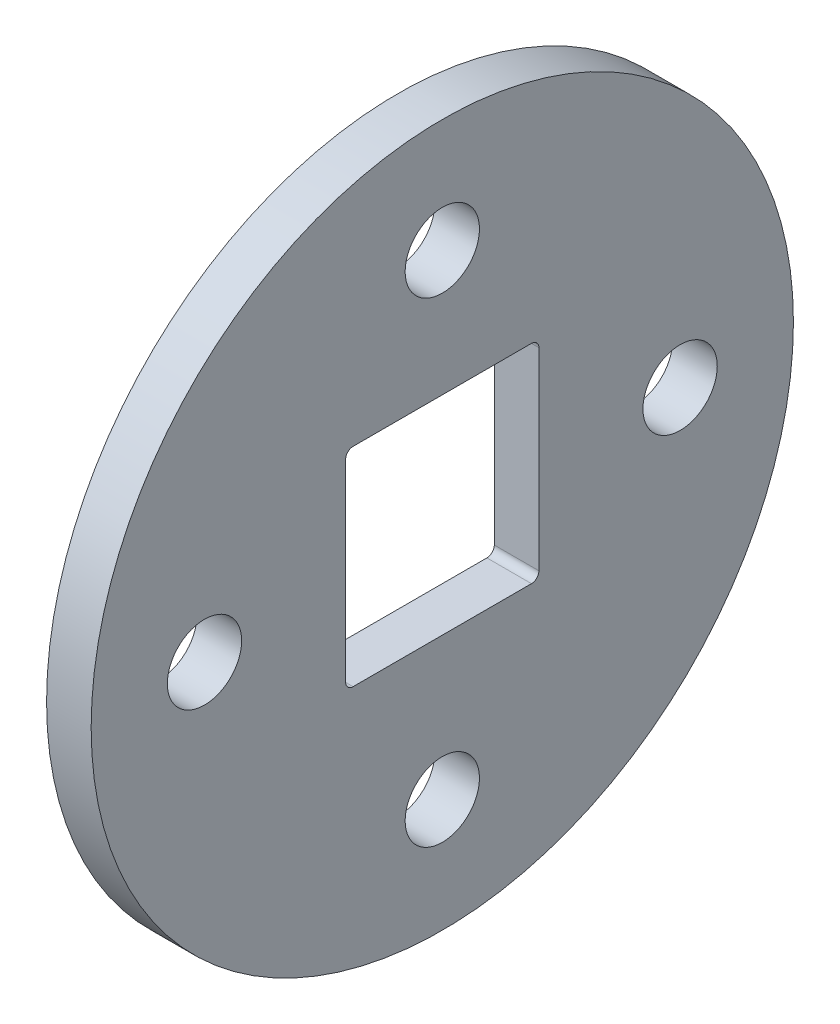
ISO-10303-21;
HEADER;
FILE_DESCRIPTION(('STEP AP214'),'2;1');
FILE_NAME('part.step','',(''),(''),'','','');
FILE_SCHEMA(('AUTOMOTIVE_DESIGN { 1 0 10303 214 1 1 1 1 }'));
ENDSEC;
DATA;
#1=APPLICATION_CONTEXT('core data for automotive mechanical design processes');
#2=APPLICATION_PROTOCOL_DEFINITION('international standard','automotive_design',2000,#1);
#3=PRODUCT_CONTEXT('',#1,'mechanical');
#4=PRODUCT('Part','Part','',(#3));
#5=PRODUCT_RELATED_PRODUCT_CATEGORY('part','',(#4));
#6=PRODUCT_DEFINITION_FORMATION('','',#4);
#7=PRODUCT_DEFINITION_CONTEXT('part definition',#1,'design');
#8=PRODUCT_DEFINITION('design','',#6,#7);
#9=PRODUCT_DEFINITION_SHAPE('','',#8);
#10=(LENGTH_UNIT() NAMED_UNIT(*) SI_UNIT(.MILLI.,.METRE.));
#11=(NAMED_UNIT(*) PLANE_ANGLE_UNIT() SI_UNIT($,.RADIAN.));
#12=(NAMED_UNIT(*) SI_UNIT($,.STERADIAN.) SOLID_ANGLE_UNIT());
#13=UNCERTAINTY_MEASURE_WITH_UNIT(LENGTH_MEASURE(1.E-05),#10,'distance_accuracy_value','');
#14=(GEOMETRIC_REPRESENTATION_CONTEXT(3) GLOBAL_UNCERTAINTY_ASSIGNED_CONTEXT((#13)) GLOBAL_UNIT_ASSIGNED_CONTEXT((#10,
#11,#12)) REPRESENTATION_CONTEXT('',''));
#15=CARTESIAN_POINT('',(0.,0.,0.));
#16=DIRECTION('',(0.,0.,1.));
#17=DIRECTION('',(1.,0.,0.));
#18=AXIS2_PLACEMENT_3D('',#15,#16,#17);
#19=CARTESIAN_POINT('',(6.,0.,0.));
#20=DIRECTION('',(1.,0.,0.));
#21=DIRECTION('',(0.,0.,-1.));
#22=AXIS2_PLACEMENT_3D('',#19,#20,#21);
#23=PLANE('',#22);
#24=CARTESIAN_POINT('',(6.,0.,-32.));
#25=DIRECTION('',(1.,0.,0.));
#26=DIRECTION('',(0.,0.,-1.));
#27=AXIS2_PLACEMENT_3D('',#24,#25,#26);
#28=CIRCLE('',#27,5.);
#29=CARTESIAN_POINT('',(6.,0.,-37.));
#30=VERTEX_POINT('',#29);
#31=EDGE_CURVE('E206',#30,#30,#28,.T.);
#32=ORIENTED_EDGE('',*,*,#31,.F.);
#33=EDGE_LOOP('',(#32));
#34=FACE_BOUND('',#33,.T.);
#35=CARTESIAN_POINT('',(6.,32.,1.1172740284298E-13));
#36=DIRECTION('',(1.,0.,0.));
#37=DIRECTION('',(0.,0.,-1.));
#38=AXIS2_PLACEMENT_3D('',#35,#36,#37);
#39=CIRCLE('',#38,5.);
#40=CARTESIAN_POINT('',(6.,32.,-4.99999999999989));
#41=VERTEX_POINT('',#40);
#42=EDGE_CURVE('E200',#41,#41,#39,.T.);
#43=ORIENTED_EDGE('',*,*,#42,.F.);
#44=EDGE_LOOP('',(#43));
#45=FACE_BOUND('',#44,.T.);
#46=CARTESIAN_POINT('',(6.,-2.23454805685961E-13,32.));
#47=DIRECTION('',(1.,0.,0.));
#48=DIRECTION('',(0.,0.,-1.));
#49=AXIS2_PLACEMENT_3D('',#46,#47,#48);
#50=CIRCLE('',#49,5.);
#51=CARTESIAN_POINT('',(6.,-2.23454805685961E-13,27.));
#52=VERTEX_POINT('',#51);
#53=EDGE_CURVE('E194',#52,#52,#50,.T.);
#54=ORIENTED_EDGE('',*,*,#53,.F.);
#55=EDGE_LOOP('',(#54));
#56=FACE_BOUND('',#55,.T.);
#57=CARTESIAN_POINT('',(6.,-32.,-3.35182208528941E-13));
#58=DIRECTION('',(1.,0.,0.));
#59=DIRECTION('',(0.,0.,-1.));
#60=AXIS2_PLACEMENT_3D('',#57,#58,#59);
#61=CIRCLE('',#60,5.);
#62=CARTESIAN_POINT('',(6.,-32.,-5.00000000000033));
#63=VERTEX_POINT('',#62);
#64=EDGE_CURVE('E187',#63,#63,#61,.T.);
#65=ORIENTED_EDGE('',*,*,#64,.F.);
#66=EDGE_LOOP('',(#65));
#67=FACE_BOUND('',#66,.T.);
#68=CARTESIAN_POINT('',(6.,0.,0.));
#69=DIRECTION('',(1.,0.,0.));
#70=DIRECTION('',(0.,0.,-1.));
#71=AXIS2_PLACEMENT_3D('',#68,#69,#70);
#72=CIRCLE('',#71,47.25);
#73=CARTESIAN_POINT('',(6.,0.,-47.25));
#74=VERTEX_POINT('',#73);
#75=EDGE_CURVE('E147',#74,#74,#72,.T.);
#76=ORIENTED_EDGE('',*,*,#75,.T.);
#77=EDGE_LOOP('',(#76));
#78=FACE_BOUND('',#77,.T.);
#79=CARTESIAN_POINT('',(6.,14.15,-12.));
#80=DIRECTION('',(1.,0.,0.));
#81=DIRECTION('',(0.,0.,-1.));
#82=AXIS2_PLACEMENT_3D('',#79,#80,#81);
#83=CIRCLE('',#82,1.);
#84=CARTESIAN_POINT('',(6.,14.15,-13.));
#85=VERTEX_POINT('',#84);
#86=CARTESIAN_POINT('',(6.,15.15,-12.));
#87=VERTEX_POINT('',#86);
#88=EDGE_CURVE('E112',#85,#87,#83,.T.);
#89=ORIENTED_EDGE('',*,*,#88,.F.);
#90=DIRECTION('',(0.,-1.,0.));
#91=VECTOR('',#90,1.);
#92=CARTESIAN_POINT('',(6.,0.,-13.));
#93=LINE('',#92,#91);
#94=CARTESIAN_POINT('',(6.,-11.85,-13.));
#95=VERTEX_POINT('',#94);
#96=EDGE_CURVE('E51',#85,#95,#93,.T.);
#97=ORIENTED_EDGE('',*,*,#96,.T.);
#98=CARTESIAN_POINT('',(6.,-11.85,-12.));
#99=DIRECTION('',(1.,0.,0.));
#100=DIRECTION('',(0.,0.,-1.));
#101=AXIS2_PLACEMENT_3D('',#98,#99,#100);
#102=CIRCLE('',#101,1.);
#103=CARTESIAN_POINT('',(6.,-12.85,-12.));
#104=VERTEX_POINT('',#103);
#105=EDGE_CURVE('E131',#95,#104,#102,.F.);
#106=ORIENTED_EDGE('',*,*,#105,.T.);
#107=DIRECTION('',(0.,0.,1.));
#108=VECTOR('',#107,1.);
#109=CARTESIAN_POINT('',(6.,-12.85,0.));
#110=LINE('',#109,#108);
#111=CARTESIAN_POINT('',(6.,-12.85,12.));
#112=VERTEX_POINT('',#111);
#113=EDGE_CURVE('E128',#104,#112,#110,.T.);
#114=ORIENTED_EDGE('',*,*,#113,.T.);
#115=CARTESIAN_POINT('',(6.,-11.85,12.));
#116=DIRECTION('',(1.,0.,0.));
#117=DIRECTION('',(0.,0.,-1.));
#118=AXIS2_PLACEMENT_3D('',#115,#116,#117);
#119=CIRCLE('',#118,1.);
#120=CARTESIAN_POINT('',(6.,-11.85,13.));
#121=VERTEX_POINT('',#120);
#122=EDGE_CURVE('E125',#121,#112,#119,.T.);
#123=ORIENTED_EDGE('',*,*,#122,.F.);
#124=DIRECTION('',(0.,1.,0.));
#125=VECTOR('',#124,1.);
#126=CARTESIAN_POINT('',(6.,0.,13.));
#127=LINE('',#126,#125);
#128=CARTESIAN_POINT('',(6.,14.15,13.));
#129=VERTEX_POINT('',#128);
#130=EDGE_CURVE('E120',#121,#129,#127,.T.);
#131=ORIENTED_EDGE('',*,*,#130,.T.);
#132=CARTESIAN_POINT('',(6.,14.15,12.));
#133=DIRECTION('',(1.,0.,0.));
#134=DIRECTION('',(0.,0.,-1.));
#135=AXIS2_PLACEMENT_3D('',#132,#133,#134);
#136=CIRCLE('',#135,1.);
#137=CARTESIAN_POINT('',(6.,15.15,12.));
#138=VERTEX_POINT('',#137);
#139=EDGE_CURVE('E118',#129,#138,#136,.F.);
#140=ORIENTED_EDGE('',*,*,#139,.T.);
#141=DIRECTION('',(0.,0.,1.));
#142=VECTOR('',#141,1.);
#143=CARTESIAN_POINT('',(6.,15.15,0.));
#144=LINE('',#143,#142);
#145=EDGE_CURVE('E103',#87,#138,#144,.T.);
#146=ORIENTED_EDGE('',*,*,#145,.F.);
#147=EDGE_LOOP('',(#89,#97,#106,#114,#123,#131,#140,#146));
#148=FACE_BOUND('',#147,.T.);
#149=ADVANCED_FACE('F36',(#34,#45,#56,#67,#78,#148),#23,.T.);
#150=CARTESIAN_POINT('',(0.,0.,0.));
#151=DIRECTION('',(1.,0.,0.));
#152=DIRECTION('',(0.,0.,-1.));
#153=AXIS2_PLACEMENT_3D('',#150,#151,#152);
#154=PLANE('',#153);
#155=CARTESIAN_POINT('',(0.,0.,-32.));
#156=DIRECTION('',(-1.,0.,0.));
#157=DIRECTION('',(0.,0.,1.));
#158=AXIS2_PLACEMENT_3D('',#155,#156,#157);
#159=CIRCLE('',#158,5.);
#160=CARTESIAN_POINT('',(0.,0.,-27.));
#161=VERTEX_POINT('',#160);
#162=EDGE_CURVE('E209',#161,#161,#159,.T.);
#163=ORIENTED_EDGE('',*,*,#162,.F.);
#164=EDGE_LOOP('',(#163));
#165=FACE_BOUND('',#164,.T.);
#166=CARTESIAN_POINT('',(0.,32.,1.1172740284298E-13));
#167=DIRECTION('',(-1.,0.,0.));
#168=DIRECTION('',(0.,0.,1.));
#169=AXIS2_PLACEMENT_3D('',#166,#167,#168);
#170=CIRCLE('',#169,5.);
#171=CARTESIAN_POINT('',(0.,32.,5.00000000000011));
#172=VERTEX_POINT('',#171);
#173=EDGE_CURVE('E203',#172,#172,#170,.T.);
#174=ORIENTED_EDGE('',*,*,#173,.F.);
#175=EDGE_LOOP('',(#174));
#176=FACE_BOUND('',#175,.T.);
#177=CARTESIAN_POINT('',(0.,-2.23454805685961E-13,32.));
#178=DIRECTION('',(-1.,0.,0.));
#179=DIRECTION('',(0.,0.,1.));
#180=AXIS2_PLACEMENT_3D('',#177,#178,#179);
#181=CIRCLE('',#180,5.);
#182=CARTESIAN_POINT('',(0.,-2.23454805685961E-13,37.));
#183=VERTEX_POINT('',#182);
#184=EDGE_CURVE('E197',#183,#183,#181,.T.);
#185=ORIENTED_EDGE('',*,*,#184,.F.);
#186=EDGE_LOOP('',(#185));
#187=FACE_BOUND('',#186,.T.);
#188=CARTESIAN_POINT('',(0.,-32.,-3.35182208528941E-13));
#189=DIRECTION('',(-1.,0.,0.));
#190=DIRECTION('',(0.,0.,1.));
#191=AXIS2_PLACEMENT_3D('',#188,#189,#190);
#192=CIRCLE('',#191,5.);
#193=CARTESIAN_POINT('',(0.,-32.,4.99999999999967));
#194=VERTEX_POINT('',#193);
#195=EDGE_CURVE('E189',#194,#194,#192,.T.);
#196=ORIENTED_EDGE('',*,*,#195,.F.);
#197=EDGE_LOOP('',(#196));
#198=FACE_BOUND('',#197,.T.);
#199=CARTESIAN_POINT('',(0.,0.,0.));
#200=DIRECTION('',(1.,0.,0.));
#201=DIRECTION('',(0.,0.,-1.));
#202=AXIS2_PLACEMENT_3D('',#199,#200,#201);
#203=CIRCLE('',#202,47.25);
#204=CARTESIAN_POINT('',(0.,0.,-47.25));
#205=VERTEX_POINT('',#204);
#206=EDGE_CURVE('E136',#205,#205,#203,.T.);
#207=ORIENTED_EDGE('',*,*,#206,.F.);
#208=EDGE_LOOP('',(#207));
#209=FACE_BOUND('',#208,.T.);
#210=DIRECTION('',(0.,-1.,0.));
#211=VECTOR('',#210,1.);
#212=CARTESIAN_POINT('',(0.,0.,-13.));
#213=LINE('',#212,#211);
#214=CARTESIAN_POINT('',(0.,14.15,-13.));
#215=VERTEX_POINT('',#214);
#216=CARTESIAN_POINT('',(0.,-11.85,-13.));
#217=VERTEX_POINT('',#216);
#218=EDGE_CURVE('E11',#215,#217,#213,.T.);
#219=ORIENTED_EDGE('',*,*,#218,.F.);
#220=CARTESIAN_POINT('',(0.,14.15,-12.));
#221=DIRECTION('',(1.,0.,0.));
#222=DIRECTION('',(0.,0.,-1.));
#223=AXIS2_PLACEMENT_3D('',#220,#221,#222);
#224=CIRCLE('',#223,1.);
#225=CARTESIAN_POINT('',(0.,15.15,-12.));
#226=VERTEX_POINT('',#225);
#227=EDGE_CURVE('E150',#215,#226,#224,.T.);
#228=ORIENTED_EDGE('',*,*,#227,.T.);
#229=DIRECTION('',(0.,0.,1.));
#230=VECTOR('',#229,1.);
#231=CARTESIAN_POINT('',(0.,15.15,0.));
#232=LINE('',#231,#230);
#233=CARTESIAN_POINT('',(0.,15.15,12.));
#234=VERTEX_POINT('',#233);
#235=EDGE_CURVE('E106',#226,#234,#232,.T.);
#236=ORIENTED_EDGE('',*,*,#235,.T.);
#237=CARTESIAN_POINT('',(0.,14.15,12.));
#238=DIRECTION('',(1.,0.,0.));
#239=DIRECTION('',(0.,0.,-1.));
#240=AXIS2_PLACEMENT_3D('',#237,#238,#239);
#241=CIRCLE('',#240,1.);
#242=CARTESIAN_POINT('',(0.,14.15,13.));
#243=VERTEX_POINT('',#242);
#244=EDGE_CURVE('E155',#243,#234,#241,.F.);
#245=ORIENTED_EDGE('',*,*,#244,.F.);
#246=DIRECTION('',(0.,1.,0.));
#247=VECTOR('',#246,1.);
#248=CARTESIAN_POINT('',(0.,0.,13.));
#249=LINE('',#248,#247);
#250=CARTESIAN_POINT('',(0.,-11.85,13.));
#251=VERTEX_POINT('',#250);
#252=EDGE_CURVE('E157',#251,#243,#249,.T.);
#253=ORIENTED_EDGE('',*,*,#252,.F.);
#254=CARTESIAN_POINT('',(0.,-11.85,12.));
#255=DIRECTION('',(1.,0.,0.));
#256=DIRECTION('',(0.,0.,-1.));
#257=AXIS2_PLACEMENT_3D('',#254,#255,#256);
#258=CIRCLE('',#257,1.);
#259=CARTESIAN_POINT('',(0.,-12.85,12.));
#260=VERTEX_POINT('',#259);
#261=EDGE_CURVE('E159',#251,#260,#258,.T.);
#262=ORIENTED_EDGE('',*,*,#261,.T.);
#263=DIRECTION('',(0.,0.,1.));
#264=VECTOR('',#263,1.);
#265=CARTESIAN_POINT('',(0.,-12.85,0.));
#266=LINE('',#265,#264);
#267=CARTESIAN_POINT('',(0.,-12.85,-12.));
#268=VERTEX_POINT('',#267);
#269=EDGE_CURVE('E162',#268,#260,#266,.T.);
#270=ORIENTED_EDGE('',*,*,#269,.F.);
#271=CARTESIAN_POINT('',(0.,-11.85,-12.));
#272=DIRECTION('',(1.,0.,0.));
#273=DIRECTION('',(0.,0.,-1.));
#274=AXIS2_PLACEMENT_3D('',#271,#272,#273);
#275=CIRCLE('',#274,1.);
#276=EDGE_CURVE('E44',#217,#268,#275,.F.);
#277=ORIENTED_EDGE('',*,*,#276,.F.);
#278=EDGE_LOOP('',(#219,#228,#236,#245,#253,#262,#270,#277));
#279=FACE_BOUND('',#278,.T.);
#280=ADVANCED_FACE('F176',(#165,#176,#187,#198,#209,#279),#154,.F.);
#281=CARTESIAN_POINT('',(6.,0.,0.));
#282=DIRECTION('',(-1.,0.,0.));
#283=DIRECTION('',(0.,0.,1.));
#284=AXIS2_PLACEMENT_3D('',#281,#282,#283);
#285=CYLINDRICAL_SURFACE('',#284,47.25);
#286=ORIENTED_EDGE('',*,*,#75,.F.);
#287=EDGE_LOOP('',(#286));
#288=FACE_BOUND('',#287,.T.);
#289=ORIENTED_EDGE('',*,*,#206,.T.);
#290=EDGE_LOOP('',(#289));
#291=FACE_BOUND('',#290,.T.);
#292=ADVANCED_FACE('F38',(#288,#291),#285,.T.);
#293=CARTESIAN_POINT('',(-14.,0.,-13.));
#294=DIRECTION('',(0.,0.,1.));
#295=DIRECTION('',(1.,0.,0.));
#296=AXIS2_PLACEMENT_3D('',#293,#294,#295);
#297=PLANE('',#296);
#298=ORIENTED_EDGE('',*,*,#218,.T.);
#299=DIRECTION('',(1.,0.,0.));
#300=VECTOR('',#299,1.);
#301=CARTESIAN_POINT('',(-14.,-11.85,-13.));
#302=LINE('',#301,#300);
#303=EDGE_CURVE('E134',#217,#95,#302,.T.);
#304=ORIENTED_EDGE('',*,*,#303,.T.);
#305=ORIENTED_EDGE('',*,*,#96,.F.);
#306=DIRECTION('',(1.,0.,0.));
#307=VECTOR('',#306,1.);
#308=CARTESIAN_POINT('',(-14.,14.15,-13.));
#309=LINE('',#308,#307);
#310=EDGE_CURVE('E109',#215,#85,#309,.T.);
#311=ORIENTED_EDGE('',*,*,#310,.F.);
#312=EDGE_LOOP('',(#298,#304,#305,#311));
#313=FACE_BOUND('',#312,.T.);
#314=ADVANCED_FACE('F226',(#313),#297,.T.);
#315=CARTESIAN_POINT('',(-14.,-11.85,-12.));
#316=DIRECTION('',(1.,0.,0.));
#317=DIRECTION('',(0.,0.,-1.));
#318=AXIS2_PLACEMENT_3D('',#315,#316,#317);
#319=CYLINDRICAL_SURFACE('',#318,1.);
#320=ORIENTED_EDGE('',*,*,#276,.T.);
#321=DIRECTION('',(1.,0.,0.));
#322=VECTOR('',#321,1.);
#323=CARTESIAN_POINT('',(-14.,-12.85,-12.));
#324=LINE('',#323,#322);
#325=EDGE_CURVE('E137',#268,#104,#324,.T.);
#326=ORIENTED_EDGE('',*,*,#325,.T.);
#327=ORIENTED_EDGE('',*,*,#105,.F.);
#328=ORIENTED_EDGE('',*,*,#303,.F.);
#329=EDGE_LOOP('',(#320,#326,#327,#328));
#330=FACE_BOUND('',#329,.T.);
#331=ADVANCED_FACE('F167',(#330),#319,.F.);
#332=CARTESIAN_POINT('',(-14.,-12.85,0.));
#333=DIRECTION('',(0.,1.,0.));
#334=DIRECTION('',(0.,0.,1.));
#335=AXIS2_PLACEMENT_3D('',#332,#333,#334);
#336=PLANE('',#335);
#337=ORIENTED_EDGE('',*,*,#269,.T.);
#338=DIRECTION('',(1.,0.,0.));
#339=VECTOR('',#338,1.);
#340=CARTESIAN_POINT('',(-14.,-12.85,12.));
#341=LINE('',#340,#339);
#342=EDGE_CURVE('E139',#260,#112,#341,.T.);
#343=ORIENTED_EDGE('',*,*,#342,.T.);
#344=ORIENTED_EDGE('',*,*,#113,.F.);
#345=ORIENTED_EDGE('',*,*,#325,.F.);
#346=EDGE_LOOP('',(#337,#343,#344,#345));
#347=FACE_BOUND('',#346,.T.);
#348=ADVANCED_FACE('F174',(#347),#336,.T.);
#349=CARTESIAN_POINT('',(-14.,-11.85,12.));
#350=DIRECTION('',(1.,0.,0.));
#351=DIRECTION('',(0.,0.,-1.));
#352=AXIS2_PLACEMENT_3D('',#349,#350,#351);
#353=CYLINDRICAL_SURFACE('',#352,1.);
#354=DIRECTION('',(1.,0.,0.));
#355=VECTOR('',#354,1.);
#356=CARTESIAN_POINT('',(-14.,-11.85,13.));
#357=LINE('',#356,#355);
#358=EDGE_CURVE('E141',#251,#121,#357,.T.);
#359=ORIENTED_EDGE('',*,*,#358,.T.);
#360=ORIENTED_EDGE('',*,*,#122,.T.);
#361=ORIENTED_EDGE('',*,*,#342,.F.);
#362=ORIENTED_EDGE('',*,*,#261,.F.);
#363=EDGE_LOOP('',(#359,#360,#361,#362));
#364=FACE_BOUND('',#363,.T.);
#365=ADVANCED_FACE('F181',(#364),#353,.F.);
#366=CARTESIAN_POINT('',(-14.,0.,13.));
#367=DIRECTION('',(0.,0.,-1.));
#368=DIRECTION('',(-1.,0.,0.));
#369=AXIS2_PLACEMENT_3D('',#366,#367,#368);
#370=PLANE('',#369);
#371=ORIENTED_EDGE('',*,*,#252,.T.);
#372=DIRECTION('',(1.,0.,0.));
#373=VECTOR('',#372,1.);
#374=CARTESIAN_POINT('',(-14.,14.15,13.));
#375=LINE('',#374,#373);
#376=EDGE_CURVE('E143',#243,#129,#375,.T.);
#377=ORIENTED_EDGE('',*,*,#376,.T.);
#378=ORIENTED_EDGE('',*,*,#130,.F.);
#379=ORIENTED_EDGE('',*,*,#358,.F.);
#380=EDGE_LOOP('',(#371,#377,#378,#379));
#381=FACE_BOUND('',#380,.T.);
#382=ADVANCED_FACE('F184',(#381),#370,.T.);
#383=CARTESIAN_POINT('',(-14.,14.15,12.));
#384=DIRECTION('',(1.,0.,0.));
#385=DIRECTION('',(0.,0.,-1.));
#386=AXIS2_PLACEMENT_3D('',#383,#384,#385);
#387=CYLINDRICAL_SURFACE('',#386,1.);
#388=ORIENTED_EDGE('',*,*,#244,.T.);
#389=DIRECTION('',(1.,0.,0.));
#390=VECTOR('',#389,1.);
#391=CARTESIAN_POINT('',(-14.,15.15,12.));
#392=LINE('',#391,#390);
#393=EDGE_CURVE('E108',#234,#138,#392,.T.);
#394=ORIENTED_EDGE('',*,*,#393,.T.);
#395=ORIENTED_EDGE('',*,*,#139,.F.);
#396=ORIENTED_EDGE('',*,*,#376,.F.);
#397=EDGE_LOOP('',(#388,#394,#395,#396));
#398=FACE_BOUND('',#397,.T.);
#399=ADVANCED_FACE('F246',(#398),#387,.F.);
#400=CARTESIAN_POINT('',(-14.,15.15,0.));
#401=DIRECTION('',(0.,1.,0.));
#402=DIRECTION('',(0.,0.,1.));
#403=AXIS2_PLACEMENT_3D('',#400,#401,#402);
#404=PLANE('',#403);
#405=DIRECTION('',(1.,0.,0.));
#406=VECTOR('',#405,1.);
#407=CARTESIAN_POINT('',(-14.,15.15,-12.));
#408=LINE('',#407,#406);
#409=EDGE_CURVE('E59',#226,#87,#408,.T.);
#410=ORIENTED_EDGE('',*,*,#409,.T.);
#411=ORIENTED_EDGE('',*,*,#145,.T.);
#412=ORIENTED_EDGE('',*,*,#393,.F.);
#413=ORIENTED_EDGE('',*,*,#235,.F.);
#414=EDGE_LOOP('',(#410,#411,#412,#413));
#415=FACE_BOUND('',#414,.T.);
#416=ADVANCED_FACE('F100',(#415),#404,.F.);
#417=CARTESIAN_POINT('',(-14.,14.15,-12.));
#418=DIRECTION('',(1.,0.,0.));
#419=DIRECTION('',(0.,0.,-1.));
#420=AXIS2_PLACEMENT_3D('',#417,#418,#419);
#421=CYLINDRICAL_SURFACE('',#420,1.);
#422=ORIENTED_EDGE('',*,*,#310,.T.);
#423=ORIENTED_EDGE('',*,*,#88,.T.);
#424=ORIENTED_EDGE('',*,*,#409,.F.);
#425=ORIENTED_EDGE('',*,*,#227,.F.);
#426=EDGE_LOOP('',(#422,#423,#424,#425));
#427=FACE_BOUND('',#426,.T.);
#428=ADVANCED_FACE('F113',(#427),#421,.F.);
#429=CARTESIAN_POINT('',(0.,-32.,-3.35182208528941E-13));
#430=DIRECTION('',(-1.,0.,0.));
#431=DIRECTION('',(0.,0.,1.));
#432=AXIS2_PLACEMENT_3D('',#429,#430,#431);
#433=CYLINDRICAL_SURFACE('',#432,5.);
#434=ORIENTED_EDGE('',*,*,#64,.T.);
#435=EDGE_LOOP('',(#434));
#436=FACE_BOUND('',#435,.T.);
#437=ORIENTED_EDGE('',*,*,#195,.T.);
#438=EDGE_LOOP('',(#437));
#439=FACE_BOUND('',#438,.T.);
#440=ADVANCED_FACE('F243',(#436,#439),#433,.F.);
#441=CARTESIAN_POINT('',(0.,-2.23454805685961E-13,32.));
#442=DIRECTION('',(-1.,0.,0.));
#443=DIRECTION('',(0.,0.,1.));
#444=AXIS2_PLACEMENT_3D('',#441,#442,#443);
#445=CYLINDRICAL_SURFACE('',#444,5.);
#446=ORIENTED_EDGE('',*,*,#53,.T.);
#447=EDGE_LOOP('',(#446));
#448=FACE_BOUND('',#447,.T.);
#449=ORIENTED_EDGE('',*,*,#184,.T.);
#450=EDGE_LOOP('',(#449));
#451=FACE_BOUND('',#450,.T.);
#452=ADVANCED_FACE('F260',(#448,#451),#445,.F.);
#453=CARTESIAN_POINT('',(0.,32.,1.1172740284298E-13));
#454=DIRECTION('',(-1.,0.,0.));
#455=DIRECTION('',(0.,0.,1.));
#456=AXIS2_PLACEMENT_3D('',#453,#454,#455);
#457=CYLINDRICAL_SURFACE('',#456,5.);
#458=ORIENTED_EDGE('',*,*,#42,.T.);
#459=EDGE_LOOP('',(#458));
#460=FACE_BOUND('',#459,.T.);
#461=ORIENTED_EDGE('',*,*,#173,.T.);
#462=EDGE_LOOP('',(#461));
#463=FACE_BOUND('',#462,.T.);
#464=ADVANCED_FACE('F264',(#460,#463),#457,.F.);
#465=CARTESIAN_POINT('',(0.,0.,-32.));
#466=DIRECTION('',(-1.,0.,0.));
#467=DIRECTION('',(0.,0.,1.));
#468=AXIS2_PLACEMENT_3D('',#465,#466,#467);
#469=CYLINDRICAL_SURFACE('',#468,5.);
#470=ORIENTED_EDGE('',*,*,#31,.T.);
#471=EDGE_LOOP('',(#470));
#472=FACE_BOUND('',#471,.T.);
#473=ORIENTED_EDGE('',*,*,#162,.T.);
#474=EDGE_LOOP('',(#473));
#475=FACE_BOUND('',#474,.T.);
#476=ADVANCED_FACE('F213',(#472,#475),#469,.F.);
#477=CLOSED_SHELL('',(#149,#280,#292,#314,#331,#348,#365,#382,#399,#416,#428,#440,#452,#464,#476));
#478=MANIFOLD_SOLID_BREP('B2',#477);
#479=ADVANCED_BREP_SHAPE_REPRESENTATION('',(#18,#478),#14);
#480=SHAPE_DEFINITION_REPRESENTATION(#9,#479);
ENDSEC;
END-ISO-10303-21;
